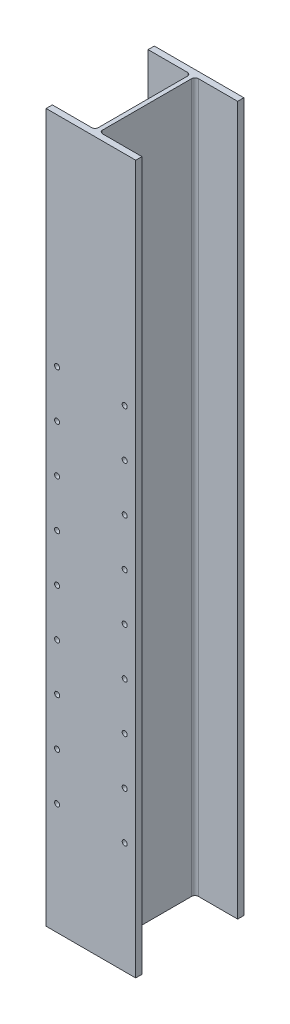
ISO-10303-21;
HEADER;
FILE_DESCRIPTION(('STEP AP214'),'2;1');
FILE_NAME('part.step','',(''),(''),'','','');
FILE_SCHEMA(('AUTOMOTIVE_DESIGN { 1 0 10303 214 1 1 1 1 }'));
ENDSEC;
DATA;
#1=APPLICATION_CONTEXT('core data for automotive mechanical design processes');
#2=APPLICATION_PROTOCOL_DEFINITION('international standard','automotive_design',2000,#1);
#3=PRODUCT_CONTEXT('',#1,'mechanical');
#4=PRODUCT('Part','Part','',(#3));
#5=PRODUCT_RELATED_PRODUCT_CATEGORY('part','',(#4));
#6=PRODUCT_DEFINITION_FORMATION('','',#4);
#7=PRODUCT_DEFINITION_CONTEXT('part definition',#1,'design');
#8=PRODUCT_DEFINITION('design','',#6,#7);
#9=PRODUCT_DEFINITION_SHAPE('','',#8);
#10=(LENGTH_UNIT() NAMED_UNIT(*) SI_UNIT(.MILLI.,.METRE.));
#11=(NAMED_UNIT(*) PLANE_ANGLE_UNIT() SI_UNIT($,.RADIAN.));
#12=(NAMED_UNIT(*) SI_UNIT($,.STERADIAN.) SOLID_ANGLE_UNIT());
#13=UNCERTAINTY_MEASURE_WITH_UNIT(LENGTH_MEASURE(1.E-05),#10,'distance_accuracy_value','');
#14=(GEOMETRIC_REPRESENTATION_CONTEXT(3) GLOBAL_UNCERTAINTY_ASSIGNED_CONTEXT((#13)) GLOBAL_UNIT_ASSIGNED_CONTEXT((#10,
#11,#12)) REPRESENTATION_CONTEXT('',''));
#15=CARTESIAN_POINT('',(0.,0.,0.));
#16=DIRECTION('',(0.,0.,1.));
#17=DIRECTION('',(1.,0.,0.));
#18=AXIS2_PLACEMENT_3D('',#15,#16,#17);
#19=CARTESIAN_POINT('',(-84.1375,665.1625,101.6));
#20=DIRECTION('',(0.,0.,-1.));
#21=DIRECTION('',(-1.,0.,0.));
#22=AXIS2_PLACEMENT_3D('',#19,#20,#21);
#23=PLANE('',#22);
#24=CARTESIAN_POINT('',(63.5,255.5875,101.6));
#25=DIRECTION('',(0.,0.,1.));
#26=DIRECTION('',(1.,0.,0.));
#27=AXIS2_PLACEMENT_3D('',#24,#25,#26);
#28=CIRCLE('',#27,4.76249999999999);
#29=CARTESIAN_POINT('',(68.2625,255.5875,101.6));
#30=VERTEX_POINT('',#29);
#31=EDGE_CURVE('E614',#30,#30,#28,.T.);
#32=ORIENTED_EDGE('',*,*,#31,.F.);
#33=EDGE_LOOP('',(#32));
#34=FACE_BOUND('',#33,.T.);
#35=CARTESIAN_POINT('',(63.4999999999999,-366.7125,101.6));
#36=DIRECTION('',(0.,0.,1.));
#37=DIRECTION('',(1.,0.,0.));
#38=AXIS2_PLACEMENT_3D('',#35,#36,#37);
#39=CIRCLE('',#38,4.76249999999999);
#40=CARTESIAN_POINT('',(68.2624999999999,-366.7125,101.6));
#41=VERTEX_POINT('',#40);
#42=EDGE_CURVE('E628',#41,#41,#39,.T.);
#43=ORIENTED_EDGE('',*,*,#42,.F.);
#44=EDGE_LOOP('',(#43));
#45=FACE_BOUND('',#44,.T.);
#46=CARTESIAN_POINT('',(63.4999999999999,-188.9125,101.6));
#47=DIRECTION('',(0.,0.,1.));
#48=DIRECTION('',(1.,0.,0.));
#49=AXIS2_PLACEMENT_3D('',#46,#47,#48);
#50=CIRCLE('',#49,4.76249999999999);
#51=CARTESIAN_POINT('',(68.2624999999999,-188.9125,101.6));
#52=VERTEX_POINT('',#51);
#53=EDGE_CURVE('E640',#52,#52,#50,.T.);
#54=ORIENTED_EDGE('',*,*,#53,.F.);
#55=EDGE_LOOP('',(#54));
#56=FACE_BOUND('',#55,.T.);
#57=CARTESIAN_POINT('',(63.4999999999999,-100.0125,101.6));
#58=DIRECTION('',(0.,0.,1.));
#59=DIRECTION('',(1.,0.,0.));
#60=AXIS2_PLACEMENT_3D('',#57,#58,#59);
#61=CIRCLE('',#60,4.76249999999999);
#62=CARTESIAN_POINT('',(68.2624999999999,-100.0125,101.6));
#63=VERTEX_POINT('',#62);
#64=EDGE_CURVE('E646',#63,#63,#61,.T.);
#65=ORIENTED_EDGE('',*,*,#64,.F.);
#66=EDGE_LOOP('',(#65));
#67=FACE_BOUND('',#66,.T.);
#68=CARTESIAN_POINT('',(-63.5,166.6875,101.6));
#69=DIRECTION('',(0.,0.,1.));
#70=DIRECTION('',(1.,0.,0.));
#71=AXIS2_PLACEMENT_3D('',#68,#69,#70);
#72=CIRCLE('',#71,4.76249999999999);
#73=CARTESIAN_POINT('',(-58.7375,166.6875,101.6));
#74=VERTEX_POINT('',#73);
#75=EDGE_CURVE('E706',#74,#74,#72,.T.);
#76=ORIENTED_EDGE('',*,*,#75,.F.);
#77=EDGE_LOOP('',(#76));
#78=FACE_BOUND('',#77,.T.);
#79=CARTESIAN_POINT('',(63.5,166.6875,101.6));
#80=DIRECTION('',(0.,0.,1.));
#81=DIRECTION('',(1.,0.,0.));
#82=AXIS2_PLACEMENT_3D('',#79,#80,#81);
#83=CIRCLE('',#82,4.76249999999999);
#84=CARTESIAN_POINT('',(68.2625,166.6875,101.6));
#85=VERTEX_POINT('',#84);
#86=EDGE_CURVE('E712',#85,#85,#83,.T.);
#87=ORIENTED_EDGE('',*,*,#86,.F.);
#88=EDGE_LOOP('',(#87));
#89=FACE_BOUND('',#88,.T.);
#90=DIRECTION('',(1.,0.,0.));
#91=VECTOR('',#90,1.);
#92=CARTESIAN_POINT('',(-84.1375,-665.1625,101.6));
#93=LINE('',#92,#91);
#94=CARTESIAN_POINT('',(-84.1375,-665.1625,101.6));
#95=VERTEX_POINT('',#94);
#96=CARTESIAN_POINT('',(84.1375,-665.1625,101.6));
#97=VERTEX_POINT('',#96);
#98=EDGE_CURVE('E194',#95,#97,#93,.T.);
#99=ORIENTED_EDGE('',*,*,#98,.T.);
#100=DIRECTION('',(0.,-1.,0.));
#101=VECTOR('',#100,1.);
#102=CARTESIAN_POINT('',(84.1375,665.1625,101.6));
#103=LINE('',#102,#101);
#104=CARTESIAN_POINT('',(84.1375,665.1625,101.6));
#105=VERTEX_POINT('',#104);
#106=EDGE_CURVE('E225',#105,#97,#103,.T.);
#107=ORIENTED_EDGE('',*,*,#106,.F.);
#108=DIRECTION('',(1.,0.,0.));
#109=VECTOR('',#108,1.);
#110=CARTESIAN_POINT('',(-84.1375,665.1625,101.6));
#111=LINE('',#110,#109);
#112=CARTESIAN_POINT('',(-84.1375,665.1625,101.6));
#113=VERTEX_POINT('',#112);
#114=EDGE_CURVE('E274',#113,#105,#111,.T.);
#115=ORIENTED_EDGE('',*,*,#114,.F.);
#116=DIRECTION('',(0.,-1.,0.));
#117=VECTOR('',#116,1.);
#118=CARTESIAN_POINT('',(-84.1375,665.1625,101.6));
#119=LINE('',#118,#117);
#120=EDGE_CURVE('E228',#113,#95,#119,.T.);
#121=ORIENTED_EDGE('',*,*,#120,.T.);
#122=EDGE_LOOP('',(#99,#107,#115,#121));
#123=FACE_BOUND('',#122,.T.);
#124=CARTESIAN_POINT('',(-63.5,77.7874999999999,101.6));
#125=DIRECTION('',(0.,0.,1.));
#126=DIRECTION('',(1.,0.,0.));
#127=AXIS2_PLACEMENT_3D('',#124,#125,#126);
#128=CIRCLE('',#127,4.76249999999999);
#129=CARTESIAN_POINT('',(-58.7375,77.7874999999999,101.6));
#130=VERTEX_POINT('',#129);
#131=EDGE_CURVE('E700',#130,#130,#128,.T.);
#132=ORIENTED_EDGE('',*,*,#131,.F.);
#133=EDGE_LOOP('',(#132));
#134=FACE_BOUND('',#133,.T.);
#135=CARTESIAN_POINT('',(-63.5,-11.1125000000001,101.6));
#136=DIRECTION('',(0.,0.,1.));
#137=DIRECTION('',(1.,0.,0.));
#138=AXIS2_PLACEMENT_3D('',#135,#136,#137);
#139=CIRCLE('',#138,4.76249999999999);
#140=CARTESIAN_POINT('',(-58.7375,-11.1125000000001,101.6));
#141=VERTEX_POINT('',#140);
#142=EDGE_CURVE('E694',#141,#141,#139,.T.);
#143=ORIENTED_EDGE('',*,*,#142,.F.);
#144=EDGE_LOOP('',(#143));
#145=FACE_BOUND('',#144,.T.);
#146=CARTESIAN_POINT('',(-63.5,-100.0125,101.6));
#147=DIRECTION('',(0.,0.,1.));
#148=DIRECTION('',(1.,0.,0.));
#149=AXIS2_PLACEMENT_3D('',#146,#147,#148);
#150=CIRCLE('',#149,4.76249999999999);
#151=CARTESIAN_POINT('',(-58.7375,-100.0125,101.6));
#152=VERTEX_POINT('',#151);
#153=EDGE_CURVE('E688',#152,#152,#150,.T.);
#154=ORIENTED_EDGE('',*,*,#153,.F.);
#155=EDGE_LOOP('',(#154));
#156=FACE_BOUND('',#155,.T.);
#157=CARTESIAN_POINT('',(-63.5,-188.9125,101.6));
#158=DIRECTION('',(0.,0.,1.));
#159=DIRECTION('',(1.,0.,0.));
#160=AXIS2_PLACEMENT_3D('',#157,#158,#159);
#161=CIRCLE('',#160,4.76249999999999);
#162=CARTESIAN_POINT('',(-58.7375,-188.9125,101.6));
#163=VERTEX_POINT('',#162);
#164=EDGE_CURVE('E682',#163,#163,#161,.T.);
#165=ORIENTED_EDGE('',*,*,#164,.F.);
#166=EDGE_LOOP('',(#165));
#167=FACE_BOUND('',#166,.T.);
#168=CARTESIAN_POINT('',(-63.4999999999999,-277.8125,101.6));
#169=DIRECTION('',(0.,0.,1.));
#170=DIRECTION('',(1.,0.,0.));
#171=AXIS2_PLACEMENT_3D('',#168,#169,#170);
#172=CIRCLE('',#171,4.76249999999999);
#173=CARTESIAN_POINT('',(-58.7375,-277.8125,101.6));
#174=VERTEX_POINT('',#173);
#175=EDGE_CURVE('E676',#174,#174,#172,.T.);
#176=ORIENTED_EDGE('',*,*,#175,.F.);
#177=EDGE_LOOP('',(#176));
#178=FACE_BOUND('',#177,.T.);
#179=CARTESIAN_POINT('',(-63.4999999999999,-366.7125,101.6));
#180=DIRECTION('',(0.,0.,1.));
#181=DIRECTION('',(1.,0.,0.));
#182=AXIS2_PLACEMENT_3D('',#179,#180,#181);
#183=CIRCLE('',#182,4.76249999999999);
#184=CARTESIAN_POINT('',(-58.7375,-366.7125,101.6));
#185=VERTEX_POINT('',#184);
#186=EDGE_CURVE('E670',#185,#185,#183,.T.);
#187=ORIENTED_EDGE('',*,*,#186,.F.);
#188=EDGE_LOOP('',(#187));
#189=FACE_BOUND('',#188,.T.);
#190=CARTESIAN_POINT('',(-63.4999999999999,-455.6125,101.6));
#191=DIRECTION('',(0.,0.,1.));
#192=DIRECTION('',(1.,0.,0.));
#193=AXIS2_PLACEMENT_3D('',#190,#191,#192);
#194=CIRCLE('',#193,4.76249999999999);
#195=CARTESIAN_POINT('',(-58.7374999999999,-455.6125,101.6));
#196=VERTEX_POINT('',#195);
#197=EDGE_CURVE('E664',#196,#196,#194,.T.);
#198=ORIENTED_EDGE('',*,*,#197,.F.);
#199=EDGE_LOOP('',(#198));
#200=FACE_BOUND('',#199,.T.);
#201=CARTESIAN_POINT('',(63.5,77.7874999999999,101.6));
#202=DIRECTION('',(0.,0.,1.));
#203=DIRECTION('',(1.,0.,0.));
#204=AXIS2_PLACEMENT_3D('',#201,#202,#203);
#205=CIRCLE('',#204,4.76249999999999);
#206=CARTESIAN_POINT('',(68.2624999999999,77.7874999999999,101.6));
#207=VERTEX_POINT('',#206);
#208=EDGE_CURVE('E658',#207,#207,#205,.T.);
#209=ORIENTED_EDGE('',*,*,#208,.F.);
#210=EDGE_LOOP('',(#209));
#211=FACE_BOUND('',#210,.T.);
#212=CARTESIAN_POINT('',(63.5,-11.1125000000001,101.6));
#213=DIRECTION('',(0.,0.,1.));
#214=DIRECTION('',(1.,0.,0.));
#215=AXIS2_PLACEMENT_3D('',#212,#213,#214);
#216=CIRCLE('',#215,4.76249999999999);
#217=CARTESIAN_POINT('',(68.2624999999999,-11.1125000000001,101.6));
#218=VERTEX_POINT('',#217);
#219=EDGE_CURVE('E652',#218,#218,#216,.T.);
#220=ORIENTED_EDGE('',*,*,#219,.F.);
#221=EDGE_LOOP('',(#220));
#222=FACE_BOUND('',#221,.T.);
#223=CARTESIAN_POINT('',(63.4999999999999,-277.8125,101.6));
#224=DIRECTION('',(0.,0.,1.));
#225=DIRECTION('',(1.,0.,0.));
#226=AXIS2_PLACEMENT_3D('',#223,#224,#225);
#227=CIRCLE('',#226,4.76249999999999);
#228=CARTESIAN_POINT('',(68.2624999999999,-277.8125,101.6));
#229=VERTEX_POINT('',#228);
#230=EDGE_CURVE('E634',#229,#229,#227,.T.);
#231=ORIENTED_EDGE('',*,*,#230,.F.);
#232=EDGE_LOOP('',(#231));
#233=FACE_BOUND('',#232,.T.);
#234=CARTESIAN_POINT('',(63.4999999999999,-455.6125,101.6));
#235=DIRECTION('',(0.,0.,1.));
#236=DIRECTION('',(1.,0.,0.));
#237=AXIS2_PLACEMENT_3D('',#234,#235,#236);
#238=CIRCLE('',#237,4.76249999999999);
#239=CARTESIAN_POINT('',(68.2624999999999,-455.6125,101.6));
#240=VERTEX_POINT('',#239);
#241=EDGE_CURVE('E622',#240,#240,#238,.T.);
#242=ORIENTED_EDGE('',*,*,#241,.F.);
#243=EDGE_LOOP('',(#242));
#244=FACE_BOUND('',#243,.T.);
#245=CARTESIAN_POINT('',(-63.5,255.5875,101.6));
#246=DIRECTION('',(0.,0.,1.));
#247=DIRECTION('',(1.,0.,0.));
#248=AXIS2_PLACEMENT_3D('',#245,#246,#247);
#249=CIRCLE('',#248,4.76249999999999);
#250=CARTESIAN_POINT('',(-58.7375,255.5875,101.6));
#251=VERTEX_POINT('',#250);
#252=EDGE_CURVE('E611',#251,#251,#249,.T.);
#253=ORIENTED_EDGE('',*,*,#252,.F.);
#254=EDGE_LOOP('',(#253));
#255=FACE_BOUND('',#254,.T.);
#256=ADVANCED_FACE('F33',(#34,#45,#56,#67,#78,#89,#123,#134,#145,#156,#167,#178,#189,#200,#211,
#222,#233,#244,#255),#23,.F.);
#257=CARTESIAN_POINT('',(-84.1375000000001,665.1625,-89.916));
#258=DIRECTION('',(1.,0.,0.));
#259=DIRECTION('',(0.,0.,-1.));
#260=AXIS2_PLACEMENT_3D('',#257,#258,#259);
#261=PLANE('',#260);
#262=DIRECTION('',(0.,0.,1.));
#263=VECTOR('',#262,1.);
#264=CARTESIAN_POINT('',(-84.1375000000001,-665.1625,-89.916));
#265=LINE('',#264,#263);
#266=CARTESIAN_POINT('',(-84.1375000000001,-665.1625,-101.6));
#267=VERTEX_POINT('',#266);
#268=CARTESIAN_POINT('',(-84.1375000000001,-665.1625,-89.916));
#269=VERTEX_POINT('',#268);
#270=EDGE_CURVE('E178',#267,#269,#265,.T.);
#271=ORIENTED_EDGE('',*,*,#270,.T.);
#272=DIRECTION('',(0.,-1.,0.));
#273=VECTOR('',#272,1.);
#274=CARTESIAN_POINT('',(-84.1375000000001,665.1625,-89.916));
#275=LINE('',#274,#273);
#276=CARTESIAN_POINT('',(-84.1375000000001,665.1625,-89.916));
#277=VERTEX_POINT('',#276);
#278=EDGE_CURVE('E11',#277,#269,#275,.T.);
#279=ORIENTED_EDGE('',*,*,#278,.F.);
#280=DIRECTION('',(0.,0.,1.));
#281=VECTOR('',#280,1.);
#282=CARTESIAN_POINT('',(-84.1375000000001,665.1625,-89.916));
#283=LINE('',#282,#281);
#284=CARTESIAN_POINT('',(-84.1375000000001,665.1625,-101.6));
#285=VERTEX_POINT('',#284);
#286=EDGE_CURVE('E209',#285,#277,#283,.T.);
#287=ORIENTED_EDGE('',*,*,#286,.F.);
#288=DIRECTION('',(0.,-1.,0.));
#289=VECTOR('',#288,1.);
#290=CARTESIAN_POINT('',(-84.1375000000001,665.1625,-101.6));
#291=LINE('',#290,#289);
#292=EDGE_CURVE('E174',#285,#267,#291,.T.);
#293=ORIENTED_EDGE('',*,*,#292,.T.);
#294=EDGE_LOOP('',(#271,#279,#287,#293));
#295=FACE_BOUND('',#294,.T.);
#296=ADVANCED_FACE('F35',(#295),#261,.F.);
#297=CARTESIAN_POINT('',(-10.31875,665.1625,-89.916));
#298=DIRECTION('',(0.,0.,-1.));
#299=DIRECTION('',(-1.,0.,0.));
#300=AXIS2_PLACEMENT_3D('',#297,#298,#299);
#301=PLANE('',#300);
#302=DIRECTION('',(1.,0.,0.));
#303=VECTOR('',#302,1.);
#304=CARTESIAN_POINT('',(-10.31875,-665.1625,-89.916));
#305=LINE('',#304,#303);
#306=CARTESIAN_POINT('',(-10.31875,-665.1625,-89.916));
#307=VERTEX_POINT('',#306);
#308=EDGE_CURVE('E181',#269,#307,#305,.T.);
#309=ORIENTED_EDGE('',*,*,#308,.T.);
#310=DIRECTION('',(0.,-1.,0.));
#311=VECTOR('',#310,1.);
#312=CARTESIAN_POINT('',(-10.31875,665.1625,-89.916));
#313=LINE('',#312,#311);
#314=CARTESIAN_POINT('',(-10.31875,665.1625,-89.916));
#315=VERTEX_POINT('',#314);
#316=EDGE_CURVE('E42',#315,#307,#313,.T.);
#317=ORIENTED_EDGE('',*,*,#316,.F.);
#318=DIRECTION('',(1.,0.,0.));
#319=VECTOR('',#318,1.);
#320=CARTESIAN_POINT('',(-10.31875,665.1625,-89.916));
#321=LINE('',#320,#319);
#322=EDGE_CURVE('E117',#277,#315,#321,.T.);
#323=ORIENTED_EDGE('',*,*,#322,.F.);
#324=ORIENTED_EDGE('',*,*,#278,.T.);
#325=EDGE_LOOP('',(#309,#317,#323,#324));
#326=FACE_BOUND('',#325,.T.);
#327=ADVANCED_FACE('F312',(#326),#301,.F.);
#328=CARTESIAN_POINT('',(-10.31875,665.1625,-83.566));
#329=DIRECTION('',(0.,-1.,0.));
#330=DIRECTION('',(0.,0.,-1.));
#331=AXIS2_PLACEMENT_3D('',#328,#329,#330);
#332=CYLINDRICAL_SURFACE('',#331,6.35);
#333=CARTESIAN_POINT('',(-10.31875,-665.1625,-83.566));
#334=DIRECTION('',(0.,-1.,0.));
#335=DIRECTION('',(0.,0.,1.));
#336=AXIS2_PLACEMENT_3D('',#333,#334,#335);
#337=CIRCLE('',#336,6.35);
#338=CARTESIAN_POINT('',(-3.96875,-665.1625,-83.566));
#339=VERTEX_POINT('',#338);
#340=EDGE_CURVE('E184',#307,#339,#337,.T.);
#341=ORIENTED_EDGE('',*,*,#340,.T.);
#342=DIRECTION('',(0.,-1.,0.));
#343=VECTOR('',#342,1.);
#344=CARTESIAN_POINT('',(-3.96875,665.1625,-83.566));
#345=LINE('',#344,#343);
#346=CARTESIAN_POINT('',(-3.96875,665.1625,-83.566));
#347=VERTEX_POINT('',#346);
#348=EDGE_CURVE('E240',#347,#339,#345,.T.);
#349=ORIENTED_EDGE('',*,*,#348,.F.);
#350=CARTESIAN_POINT('',(-10.31875,665.1625,-83.566));
#351=DIRECTION('',(0.,-1.,0.));
#352=DIRECTION('',(0.,0.,1.));
#353=AXIS2_PLACEMENT_3D('',#350,#351,#352);
#354=CIRCLE('',#353,6.35);
#355=EDGE_CURVE('E248',#315,#347,#354,.T.);
#356=ORIENTED_EDGE('',*,*,#355,.F.);
#357=ORIENTED_EDGE('',*,*,#316,.T.);
#358=EDGE_LOOP('',(#341,#349,#356,#357));
#359=FACE_BOUND('',#358,.T.);
#360=ADVANCED_FACE('F246',(#359),#332,.F.);
#361=CARTESIAN_POINT('',(-3.96875,665.1625,-83.566));
#362=DIRECTION('',(1.,0.,0.));
#363=DIRECTION('',(0.,0.,-1.));
#364=AXIS2_PLACEMENT_3D('',#361,#362,#363);
#365=PLANE('',#364);
#366=DIRECTION('',(0.,0.,1.));
#367=VECTOR('',#366,1.);
#368=CARTESIAN_POINT('',(-3.96875,-665.1625,-83.566));
#369=LINE('',#368,#367);
#370=CARTESIAN_POINT('',(-3.96874999999998,-665.1625,83.566));
#371=VERTEX_POINT('',#370);
#372=EDGE_CURVE('E186',#339,#371,#369,.T.);
#373=ORIENTED_EDGE('',*,*,#372,.T.);
#374=DIRECTION('',(0.,-1.,0.));
#375=VECTOR('',#374,1.);
#376=CARTESIAN_POINT('',(-3.96874999999998,665.1625,83.566));
#377=LINE('',#376,#375);
#378=CARTESIAN_POINT('',(-3.96874999999998,665.1625,83.566));
#379=VERTEX_POINT('',#378);
#380=EDGE_CURVE('E237',#379,#371,#377,.T.);
#381=ORIENTED_EDGE('',*,*,#380,.F.);
#382=DIRECTION('',(0.,0.,1.));
#383=VECTOR('',#382,1.);
#384=CARTESIAN_POINT('',(-3.96875,665.1625,-83.566));
#385=LINE('',#384,#383);
#386=EDGE_CURVE('E266',#347,#379,#385,.T.);
#387=ORIENTED_EDGE('',*,*,#386,.F.);
#388=ORIENTED_EDGE('',*,*,#348,.T.);
#389=EDGE_LOOP('',(#373,#381,#387,#388));
#390=FACE_BOUND('',#389,.T.);
#391=ADVANCED_FACE('F257',(#390),#365,.F.);
#392=CARTESIAN_POINT('',(-10.31875,665.1625,83.566));
#393=DIRECTION('',(0.,-1.,0.));
#394=DIRECTION('',(0.,0.,-1.));
#395=AXIS2_PLACEMENT_3D('',#392,#393,#394);
#396=CYLINDRICAL_SURFACE('',#395,6.35);
#397=CARTESIAN_POINT('',(-10.31875,-665.1625,83.566));
#398=DIRECTION('',(0.,-1.,0.));
#399=DIRECTION('',(0.,0.,1.));
#400=AXIS2_PLACEMENT_3D('',#397,#398,#399);
#401=CIRCLE('',#400,6.35);
#402=CARTESIAN_POINT('',(-10.31875,-665.1625,89.916));
#403=VERTEX_POINT('',#402);
#404=EDGE_CURVE('E188',#371,#403,#401,.T.);
#405=ORIENTED_EDGE('',*,*,#404,.T.);
#406=DIRECTION('',(0.,-1.,0.));
#407=VECTOR('',#406,1.);
#408=CARTESIAN_POINT('',(-10.31875,665.1625,89.916));
#409=LINE('',#408,#407);
#410=CARTESIAN_POINT('',(-10.31875,665.1625,89.916));
#411=VERTEX_POINT('',#410);
#412=EDGE_CURVE('E234',#411,#403,#409,.T.);
#413=ORIENTED_EDGE('',*,*,#412,.F.);
#414=CARTESIAN_POINT('',(-10.31875,665.1625,83.566));
#415=DIRECTION('',(0.,-1.,0.));
#416=DIRECTION('',(0.,0.,1.));
#417=AXIS2_PLACEMENT_3D('',#414,#415,#416);
#418=CIRCLE('',#417,6.35);
#419=EDGE_CURVE('E263',#379,#411,#418,.T.);
#420=ORIENTED_EDGE('',*,*,#419,.F.);
#421=ORIENTED_EDGE('',*,*,#380,.T.);
#422=EDGE_LOOP('',(#405,#413,#420,#421));
#423=FACE_BOUND('',#422,.T.);
#424=ADVANCED_FACE('F261',(#423),#396,.F.);
#425=CARTESIAN_POINT('',(-10.31875,665.1625,89.916));
#426=DIRECTION('',(0.,0.,1.));
#427=DIRECTION('',(1.,0.,0.));
#428=AXIS2_PLACEMENT_3D('',#425,#426,#427);
#429=PLANE('',#428);
#430=CARTESIAN_POINT('',(-63.5,255.5875,89.916));
#431=DIRECTION('',(0.,0.,1.));
#432=DIRECTION('',(1.,0.,0.));
#433=AXIS2_PLACEMENT_3D('',#430,#431,#432);
#434=CIRCLE('',#433,4.76249999999999);
#435=CARTESIAN_POINT('',(-58.7375,255.5875,89.916));
#436=VERTEX_POINT('',#435);
#437=EDGE_CURVE('E608',#436,#436,#434,.T.);
#438=ORIENTED_EDGE('',*,*,#437,.T.);
#439=EDGE_LOOP('',(#438));
#440=FACE_BOUND('',#439,.T.);
#441=CARTESIAN_POINT('',(-63.4999999999999,-455.6125,89.916));
#442=DIRECTION('',(0.,0.,1.));
#443=DIRECTION('',(1.,0.,0.));
#444=AXIS2_PLACEMENT_3D('',#441,#442,#443);
#445=CIRCLE('',#444,4.76249999999999);
#446=CARTESIAN_POINT('',(-58.7374999999999,-455.6125,89.916));
#447=VERTEX_POINT('',#446);
#448=EDGE_CURVE('E667',#447,#447,#445,.T.);
#449=ORIENTED_EDGE('',*,*,#448,.T.);
#450=EDGE_LOOP('',(#449));
#451=FACE_BOUND('',#450,.T.);
#452=CARTESIAN_POINT('',(-63.4999999999999,-366.7125,89.916));
#453=DIRECTION('',(0.,0.,1.));
#454=DIRECTION('',(1.,0.,0.));
#455=AXIS2_PLACEMENT_3D('',#452,#453,#454);
#456=CIRCLE('',#455,4.76249999999999);
#457=CARTESIAN_POINT('',(-58.7375,-366.7125,89.916));
#458=VERTEX_POINT('',#457);
#459=EDGE_CURVE('E673',#458,#458,#456,.T.);
#460=ORIENTED_EDGE('',*,*,#459,.T.);
#461=EDGE_LOOP('',(#460));
#462=FACE_BOUND('',#461,.T.);
#463=CARTESIAN_POINT('',(-63.4999999999999,-277.8125,89.916));
#464=DIRECTION('',(0.,0.,1.));
#465=DIRECTION('',(1.,0.,0.));
#466=AXIS2_PLACEMENT_3D('',#463,#464,#465);
#467=CIRCLE('',#466,4.76249999999999);
#468=CARTESIAN_POINT('',(-58.7375,-277.8125,89.916));
#469=VERTEX_POINT('',#468);
#470=EDGE_CURVE('E679',#469,#469,#467,.T.);
#471=ORIENTED_EDGE('',*,*,#470,.T.);
#472=EDGE_LOOP('',(#471));
#473=FACE_BOUND('',#472,.T.);
#474=CARTESIAN_POINT('',(-63.5,-188.9125,89.916));
#475=DIRECTION('',(0.,0.,1.));
#476=DIRECTION('',(1.,0.,0.));
#477=AXIS2_PLACEMENT_3D('',#474,#475,#476);
#478=CIRCLE('',#477,4.76249999999999);
#479=CARTESIAN_POINT('',(-58.7375,-188.9125,89.916));
#480=VERTEX_POINT('',#479);
#481=EDGE_CURVE('E685',#480,#480,#478,.T.);
#482=ORIENTED_EDGE('',*,*,#481,.T.);
#483=EDGE_LOOP('',(#482));
#484=FACE_BOUND('',#483,.T.);
#485=CARTESIAN_POINT('',(-63.5,-100.0125,89.916));
#486=DIRECTION('',(0.,0.,1.));
#487=DIRECTION('',(1.,0.,0.));
#488=AXIS2_PLACEMENT_3D('',#485,#486,#487);
#489=CIRCLE('',#488,4.76249999999999);
#490=CARTESIAN_POINT('',(-58.7375,-100.0125,89.916));
#491=VERTEX_POINT('',#490);
#492=EDGE_CURVE('E691',#491,#491,#489,.T.);
#493=ORIENTED_EDGE('',*,*,#492,.T.);
#494=EDGE_LOOP('',(#493));
#495=FACE_BOUND('',#494,.T.);
#496=CARTESIAN_POINT('',(-63.5,-11.1125000000001,89.916));
#497=DIRECTION('',(0.,0.,1.));
#498=DIRECTION('',(1.,0.,0.));
#499=AXIS2_PLACEMENT_3D('',#496,#497,#498);
#500=CIRCLE('',#499,4.76249999999999);
#501=CARTESIAN_POINT('',(-58.7375,-11.1125000000001,89.916));
#502=VERTEX_POINT('',#501);
#503=EDGE_CURVE('E697',#502,#502,#500,.T.);
#504=ORIENTED_EDGE('',*,*,#503,.T.);
#505=EDGE_LOOP('',(#504));
#506=FACE_BOUND('',#505,.T.);
#507=CARTESIAN_POINT('',(-63.5,77.7874999999999,89.916));
#508=DIRECTION('',(0.,0.,1.));
#509=DIRECTION('',(1.,0.,0.));
#510=AXIS2_PLACEMENT_3D('',#507,#508,#509);
#511=CIRCLE('',#510,4.76249999999999);
#512=CARTESIAN_POINT('',(-58.7375,77.7874999999999,89.916));
#513=VERTEX_POINT('',#512);
#514=EDGE_CURVE('E703',#513,#513,#511,.T.);
#515=ORIENTED_EDGE('',*,*,#514,.T.);
#516=EDGE_LOOP('',(#515));
#517=FACE_BOUND('',#516,.T.);
#518=CARTESIAN_POINT('',(-63.5,166.6875,89.916));
#519=DIRECTION('',(0.,0.,1.));
#520=DIRECTION('',(1.,0.,0.));
#521=AXIS2_PLACEMENT_3D('',#518,#519,#520);
#522=CIRCLE('',#521,4.76249999999999);
#523=CARTESIAN_POINT('',(-58.7375,166.6875,89.916));
#524=VERTEX_POINT('',#523);
#525=EDGE_CURVE('E709',#524,#524,#522,.T.);
#526=ORIENTED_EDGE('',*,*,#525,.T.);
#527=EDGE_LOOP('',(#526));
#528=FACE_BOUND('',#527,.T.);
#529=DIRECTION('',(-1.,0.,0.));
#530=VECTOR('',#529,1.);
#531=CARTESIAN_POINT('',(-10.31875,-665.1625,89.916));
#532=LINE('',#531,#530);
#533=CARTESIAN_POINT('',(-84.1375,-665.1625,89.916));
#534=VERTEX_POINT('',#533);
#535=EDGE_CURVE('E190',#403,#534,#532,.T.);
#536=ORIENTED_EDGE('',*,*,#535,.T.);
#537=DIRECTION('',(0.,-1.,0.));
#538=VECTOR('',#537,1.);
#539=CARTESIAN_POINT('',(-84.1375,665.1625,89.916));
#540=LINE('',#539,#538);
#541=CARTESIAN_POINT('',(-84.1375,665.1625,89.916));
#542=VERTEX_POINT('',#541);
#543=EDGE_CURVE('E231',#542,#534,#540,.T.);
#544=ORIENTED_EDGE('',*,*,#543,.F.);
#545=DIRECTION('',(-1.,0.,0.));
#546=VECTOR('',#545,1.);
#547=CARTESIAN_POINT('',(-10.31875,665.1625,89.916));
#548=LINE('',#547,#546);
#549=EDGE_CURVE('E265',#411,#542,#548,.T.);
#550=ORIENTED_EDGE('',*,*,#549,.F.);
#551=ORIENTED_EDGE('',*,*,#412,.T.);
#552=EDGE_LOOP('',(#536,#544,#550,#551));
#553=FACE_BOUND('',#552,.T.);
#554=ADVANCED_FACE('F322',(#440,#451,#462,#473,#484,#495,#506,#517,#528,#553),#429,.F.);
#555=CARTESIAN_POINT('',(-84.1375,665.1625,89.916));
#556=DIRECTION('',(1.,0.,0.));
#557=DIRECTION('',(0.,0.,-1.));
#558=AXIS2_PLACEMENT_3D('',#555,#556,#557);
#559=PLANE('',#558);
#560=DIRECTION('',(0.,0.,1.));
#561=VECTOR('',#560,1.);
#562=CARTESIAN_POINT('',(-84.1375,-665.1625,89.916));
#563=LINE('',#562,#561);
#564=EDGE_CURVE('E192',#534,#95,#563,.T.);
#565=ORIENTED_EDGE('',*,*,#564,.T.);
#566=ORIENTED_EDGE('',*,*,#120,.F.);
#567=DIRECTION('',(0.,0.,1.));
#568=VECTOR('',#567,1.);
#569=CARTESIAN_POINT('',(-84.1375,665.1625,89.916));
#570=LINE('',#569,#568);
#571=EDGE_CURVE('E268',#542,#113,#570,.T.);
#572=ORIENTED_EDGE('',*,*,#571,.F.);
#573=ORIENTED_EDGE('',*,*,#543,.T.);
#574=EDGE_LOOP('',(#565,#566,#572,#573));
#575=FACE_BOUND('',#574,.T.);
#576=ADVANCED_FACE('F319',(#575),#559,.F.);
#577=CARTESIAN_POINT('',(84.1375000000001,665.1625,89.916));
#578=DIRECTION('',(-1.,0.,0.));
#579=DIRECTION('',(0.,0.,1.));
#580=AXIS2_PLACEMENT_3D('',#577,#578,#579);
#581=PLANE('',#580);
#582=DIRECTION('',(0.,0.,-1.));
#583=VECTOR('',#582,1.);
#584=CARTESIAN_POINT('',(84.1375000000001,-665.1625,89.916));
#585=LINE('',#584,#583);
#586=CARTESIAN_POINT('',(84.1375000000001,-665.1625,89.916));
#587=VERTEX_POINT('',#586);
#588=EDGE_CURVE('E196',#97,#587,#585,.T.);
#589=ORIENTED_EDGE('',*,*,#588,.T.);
#590=DIRECTION('',(0.,-1.,0.));
#591=VECTOR('',#590,1.);
#592=CARTESIAN_POINT('',(84.1375000000001,665.1625,89.916));
#593=LINE('',#592,#591);
#594=CARTESIAN_POINT('',(84.1375000000001,665.1625,89.916));
#595=VERTEX_POINT('',#594);
#596=EDGE_CURVE('E222',#595,#587,#593,.T.);
#597=ORIENTED_EDGE('',*,*,#596,.F.);
#598=DIRECTION('',(0.,0.,-1.));
#599=VECTOR('',#598,1.);
#600=CARTESIAN_POINT('',(84.1375000000001,665.1625,89.916));
#601=LINE('',#600,#599);
#602=EDGE_CURVE('E276',#105,#595,#601,.T.);
#603=ORIENTED_EDGE('',*,*,#602,.F.);
#604=ORIENTED_EDGE('',*,*,#106,.T.);
#605=EDGE_LOOP('',(#589,#597,#603,#604));
#606=FACE_BOUND('',#605,.T.);
#607=ADVANCED_FACE('F317',(#606),#581,.F.);
#608=CARTESIAN_POINT('',(84.1375000000001,665.1625,89.916));
#609=DIRECTION('',(0.,0.,1.));
#610=DIRECTION('',(1.,0.,0.));
#611=AXIS2_PLACEMENT_3D('',#608,#609,#610);
#612=PLANE('',#611);
#613=CARTESIAN_POINT('',(63.5,255.5875,89.916));
#614=DIRECTION('',(0.,0.,1.));
#615=DIRECTION('',(1.,0.,0.));
#616=AXIS2_PLACEMENT_3D('',#613,#614,#615);
#617=CIRCLE('',#616,4.7625);
#618=CARTESIAN_POINT('',(68.2625,255.5875,89.916));
#619=VERTEX_POINT('',#618);
#620=EDGE_CURVE('E619',#619,#619,#617,.T.);
#621=ORIENTED_EDGE('',*,*,#620,.T.);
#622=EDGE_LOOP('',(#621));
#623=FACE_BOUND('',#622,.T.);
#624=CARTESIAN_POINT('',(63.4999999999999,-455.6125,89.916));
#625=DIRECTION('',(0.,0.,1.));
#626=DIRECTION('',(1.,0.,0.));
#627=AXIS2_PLACEMENT_3D('',#624,#625,#626);
#628=CIRCLE('',#627,4.7625);
#629=CARTESIAN_POINT('',(68.2624999999999,-455.6125,89.916));
#630=VERTEX_POINT('',#629);
#631=EDGE_CURVE('E625',#630,#630,#628,.T.);
#632=ORIENTED_EDGE('',*,*,#631,.T.);
#633=EDGE_LOOP('',(#632));
#634=FACE_BOUND('',#633,.T.);
#635=CARTESIAN_POINT('',(63.4999999999999,-366.7125,89.916));
#636=DIRECTION('',(0.,0.,1.));
#637=DIRECTION('',(1.,0.,0.));
#638=AXIS2_PLACEMENT_3D('',#635,#636,#637);
#639=CIRCLE('',#638,4.7625);
#640=CARTESIAN_POINT('',(68.2624999999999,-366.7125,89.916));
#641=VERTEX_POINT('',#640);
#642=EDGE_CURVE('E631',#641,#641,#639,.T.);
#643=ORIENTED_EDGE('',*,*,#642,.T.);
#644=EDGE_LOOP('',(#643));
#645=FACE_BOUND('',#644,.T.);
#646=CARTESIAN_POINT('',(63.4999999999999,-277.8125,89.916));
#647=DIRECTION('',(0.,0.,1.));
#648=DIRECTION('',(1.,0.,0.));
#649=AXIS2_PLACEMENT_3D('',#646,#647,#648);
#650=CIRCLE('',#649,4.7625);
#651=CARTESIAN_POINT('',(68.2624999999999,-277.8125,89.916));
#652=VERTEX_POINT('',#651);
#653=EDGE_CURVE('E637',#652,#652,#650,.T.);
#654=ORIENTED_EDGE('',*,*,#653,.T.);
#655=EDGE_LOOP('',(#654));
#656=FACE_BOUND('',#655,.T.);
#657=CARTESIAN_POINT('',(63.4999999999999,-188.9125,89.916));
#658=DIRECTION('',(0.,0.,1.));
#659=DIRECTION('',(1.,0.,0.));
#660=AXIS2_PLACEMENT_3D('',#657,#658,#659);
#661=CIRCLE('',#660,4.7625);
#662=CARTESIAN_POINT('',(68.2624999999999,-188.9125,89.916));
#663=VERTEX_POINT('',#662);
#664=EDGE_CURVE('E643',#663,#663,#661,.T.);
#665=ORIENTED_EDGE('',*,*,#664,.T.);
#666=EDGE_LOOP('',(#665));
#667=FACE_BOUND('',#666,.T.);
#668=CARTESIAN_POINT('',(63.4999999999999,-100.0125,89.916));
#669=DIRECTION('',(0.,0.,1.));
#670=DIRECTION('',(1.,0.,0.));
#671=AXIS2_PLACEMENT_3D('',#668,#669,#670);
#672=CIRCLE('',#671,4.7625);
#673=CARTESIAN_POINT('',(68.2624999999999,-100.0125,89.916));
#674=VERTEX_POINT('',#673);
#675=EDGE_CURVE('E649',#674,#674,#672,.T.);
#676=ORIENTED_EDGE('',*,*,#675,.T.);
#677=EDGE_LOOP('',(#676));
#678=FACE_BOUND('',#677,.T.);
#679=CARTESIAN_POINT('',(63.5,-11.1125000000001,89.916));
#680=DIRECTION('',(0.,0.,1.));
#681=DIRECTION('',(1.,0.,0.));
#682=AXIS2_PLACEMENT_3D('',#679,#680,#681);
#683=CIRCLE('',#682,4.7625);
#684=CARTESIAN_POINT('',(68.2624999999999,-11.1125000000001,89.916));
#685=VERTEX_POINT('',#684);
#686=EDGE_CURVE('E655',#685,#685,#683,.T.);
#687=ORIENTED_EDGE('',*,*,#686,.T.);
#688=EDGE_LOOP('',(#687));
#689=FACE_BOUND('',#688,.T.);
#690=CARTESIAN_POINT('',(63.5,77.7874999999999,89.916));
#691=DIRECTION('',(0.,0.,1.));
#692=DIRECTION('',(1.,0.,0.));
#693=AXIS2_PLACEMENT_3D('',#690,#691,#692);
#694=CIRCLE('',#693,4.7625);
#695=CARTESIAN_POINT('',(68.2624999999999,77.7874999999999,89.916));
#696=VERTEX_POINT('',#695);
#697=EDGE_CURVE('E661',#696,#696,#694,.T.);
#698=ORIENTED_EDGE('',*,*,#697,.T.);
#699=EDGE_LOOP('',(#698));
#700=FACE_BOUND('',#699,.T.);
#701=CARTESIAN_POINT('',(63.5,166.6875,89.916));
#702=DIRECTION('',(0.,0.,1.));
#703=DIRECTION('',(1.,0.,0.));
#704=AXIS2_PLACEMENT_3D('',#701,#702,#703);
#705=CIRCLE('',#704,4.7625);
#706=CARTESIAN_POINT('',(68.2625,166.6875,89.916));
#707=VERTEX_POINT('',#706);
#708=EDGE_CURVE('E182',#707,#707,#705,.T.);
#709=ORIENTED_EDGE('',*,*,#708,.T.);
#710=EDGE_LOOP('',(#709));
#711=FACE_BOUND('',#710,.T.);
#712=DIRECTION('',(-1.,0.,0.));
#713=VECTOR('',#712,1.);
#714=CARTESIAN_POINT('',(84.1375000000001,-665.1625,89.916));
#715=LINE('',#714,#713);
#716=CARTESIAN_POINT('',(10.3187500000001,-665.1625,89.916));
#717=VERTEX_POINT('',#716);
#718=EDGE_CURVE('E198',#587,#717,#715,.T.);
#719=ORIENTED_EDGE('',*,*,#718,.T.);
#720=DIRECTION('',(0.,-1.,0.));
#721=VECTOR('',#720,1.);
#722=CARTESIAN_POINT('',(10.3187500000001,665.1625,89.916));
#723=LINE('',#722,#721);
#724=CARTESIAN_POINT('',(10.3187500000001,665.1625,89.916));
#725=VERTEX_POINT('',#724);
#726=EDGE_CURVE('E219',#725,#717,#723,.T.);
#727=ORIENTED_EDGE('',*,*,#726,.F.);
#728=DIRECTION('',(-1.,0.,0.));
#729=VECTOR('',#728,1.);
#730=CARTESIAN_POINT('',(84.1375000000001,665.1625,89.916));
#731=LINE('',#730,#729);
#732=EDGE_CURVE('E278',#595,#725,#731,.T.);
#733=ORIENTED_EDGE('',*,*,#732,.F.);
#734=ORIENTED_EDGE('',*,*,#596,.T.);
#735=EDGE_LOOP('',(#719,#727,#733,#734));
#736=FACE_BOUND('',#735,.T.);
#737=ADVANCED_FACE('F364',(#623,#634,#645,#656,#667,#678,#689,#700,#711,#736),#612,.F.);
#738=CARTESIAN_POINT('',(10.31875,665.1625,83.566));
#739=DIRECTION('',(0.,-1.,0.));
#740=DIRECTION('',(0.,0.,-1.));
#741=AXIS2_PLACEMENT_3D('',#738,#739,#740);
#742=CYLINDRICAL_SURFACE('',#741,6.35);
#743=CARTESIAN_POINT('',(10.31875,-665.1625,83.566));
#744=DIRECTION('',(0.,-1.,0.));
#745=DIRECTION('',(0.,0.,-1.));
#746=AXIS2_PLACEMENT_3D('',#743,#744,#745);
#747=CIRCLE('',#746,6.35);
#748=CARTESIAN_POINT('',(3.96875000000002,-665.1625,83.566));
#749=VERTEX_POINT('',#748);
#750=EDGE_CURVE('E200',#717,#749,#747,.T.);
#751=ORIENTED_EDGE('',*,*,#750,.T.);
#752=DIRECTION('',(0.,-1.,0.));
#753=VECTOR('',#752,1.);
#754=CARTESIAN_POINT('',(3.96875000000002,665.1625,83.566));
#755=LINE('',#754,#753);
#756=CARTESIAN_POINT('',(3.96875000000002,665.1625,83.566));
#757=VERTEX_POINT('',#756);
#758=EDGE_CURVE('E216',#757,#749,#755,.T.);
#759=ORIENTED_EDGE('',*,*,#758,.F.);
#760=CARTESIAN_POINT('',(10.31875,665.1625,83.566));
#761=DIRECTION('',(0.,-1.,0.));
#762=DIRECTION('',(0.,0.,-1.));
#763=AXIS2_PLACEMENT_3D('',#760,#761,#762);
#764=CIRCLE('',#763,6.35);
#765=EDGE_CURVE('E280',#725,#757,#764,.T.);
#766=ORIENTED_EDGE('',*,*,#765,.F.);
#767=ORIENTED_EDGE('',*,*,#726,.T.);
#768=EDGE_LOOP('',(#751,#759,#766,#767));
#769=FACE_BOUND('',#768,.T.);
#770=ADVANCED_FACE('F371',(#769),#742,.F.);
#771=CARTESIAN_POINT('',(3.96875000000002,665.1625,83.566));
#772=DIRECTION('',(-1.,0.,0.));
#773=DIRECTION('',(0.,0.,1.));
#774=AXIS2_PLACEMENT_3D('',#771,#772,#773);
#775=PLANE('',#774);
#776=DIRECTION('',(0.,0.,-1.));
#777=VECTOR('',#776,1.);
#778=CARTESIAN_POINT('',(3.96875000000002,-665.1625,83.566));
#779=LINE('',#778,#777);
#780=CARTESIAN_POINT('',(3.96875,-665.1625,-83.566));
#781=VERTEX_POINT('',#780);
#782=EDGE_CURVE('E202',#749,#781,#779,.T.);
#783=ORIENTED_EDGE('',*,*,#782,.T.);
#784=DIRECTION('',(0.,-1.,0.));
#785=VECTOR('',#784,1.);
#786=CARTESIAN_POINT('',(3.96875,665.1625,-83.566));
#787=LINE('',#786,#785);
#788=CARTESIAN_POINT('',(3.96875,665.1625,-83.566));
#789=VERTEX_POINT('',#788);
#790=EDGE_CURVE('E213',#789,#781,#787,.T.);
#791=ORIENTED_EDGE('',*,*,#790,.F.);
#792=DIRECTION('',(0.,0.,-1.));
#793=VECTOR('',#792,1.);
#794=CARTESIAN_POINT('',(3.96875000000002,665.1625,83.566));
#795=LINE('',#794,#793);
#796=EDGE_CURVE('E282',#757,#789,#795,.T.);
#797=ORIENTED_EDGE('',*,*,#796,.F.);
#798=ORIENTED_EDGE('',*,*,#758,.T.);
#799=EDGE_LOOP('',(#783,#791,#797,#798));
#800=FACE_BOUND('',#799,.T.);
#801=ADVANCED_FACE('F288',(#800),#775,.F.);
#802=CARTESIAN_POINT('',(10.31875,665.1625,-83.566));
#803=DIRECTION('',(0.,-1.,0.));
#804=DIRECTION('',(0.,0.,-1.));
#805=AXIS2_PLACEMENT_3D('',#802,#803,#804);
#806=CYLINDRICAL_SURFACE('',#805,6.35);
#807=CARTESIAN_POINT('',(10.31875,-665.1625,-83.566));
#808=DIRECTION('',(0.,-1.,0.));
#809=DIRECTION('',(0.,0.,-1.));
#810=AXIS2_PLACEMENT_3D('',#807,#808,#809);
#811=CIRCLE('',#810,6.35);
#812=CARTESIAN_POINT('',(10.31875,-665.1625,-89.916));
#813=VERTEX_POINT('',#812);
#814=EDGE_CURVE('E204',#781,#813,#811,.T.);
#815=ORIENTED_EDGE('',*,*,#814,.T.);
#816=DIRECTION('',(0.,-1.,0.));
#817=VECTOR('',#816,1.);
#818=CARTESIAN_POINT('',(10.31875,665.1625,-89.916));
#819=LINE('',#818,#817);
#820=CARTESIAN_POINT('',(10.31875,665.1625,-89.916));
#821=VERTEX_POINT('',#820);
#822=EDGE_CURVE('E169',#821,#813,#819,.T.);
#823=ORIENTED_EDGE('',*,*,#822,.F.);
#824=CARTESIAN_POINT('',(10.31875,665.1625,-83.566));
#825=DIRECTION('',(0.,-1.,0.));
#826=DIRECTION('',(0.,0.,-1.));
#827=AXIS2_PLACEMENT_3D('',#824,#825,#826);
#828=CIRCLE('',#827,6.35);
#829=EDGE_CURVE('E160',#789,#821,#828,.T.);
#830=ORIENTED_EDGE('',*,*,#829,.F.);
#831=ORIENTED_EDGE('',*,*,#790,.T.);
#832=EDGE_LOOP('',(#815,#823,#830,#831));
#833=FACE_BOUND('',#832,.T.);
#834=ADVANCED_FACE('F292',(#833),#806,.F.);
#835=CARTESIAN_POINT('',(84.1375000000001,665.1625,-89.916));
#836=DIRECTION('',(0.,0.,-1.));
#837=DIRECTION('',(-1.,0.,0.));
#838=AXIS2_PLACEMENT_3D('',#835,#836,#837);
#839=PLANE('',#838);
#840=DIRECTION('',(1.,0.,0.));
#841=VECTOR('',#840,1.);
#842=CARTESIAN_POINT('',(84.1375000000001,-665.1625,-89.916));
#843=LINE('',#842,#841);
#844=CARTESIAN_POINT('',(84.1375000000001,-665.1625,-89.916));
#845=VERTEX_POINT('',#844);
#846=EDGE_CURVE('E168',#813,#845,#843,.T.);
#847=ORIENTED_EDGE('',*,*,#846,.T.);
#848=DIRECTION('',(0.,-1.,0.));
#849=VECTOR('',#848,1.);
#850=CARTESIAN_POINT('',(84.1375000000001,665.1625,-89.916));
#851=LINE('',#850,#849);
#852=CARTESIAN_POINT('',(84.1375000000001,665.1625,-89.916));
#853=VERTEX_POINT('',#852);
#854=EDGE_CURVE('E165',#853,#845,#851,.T.);
#855=ORIENTED_EDGE('',*,*,#854,.F.);
#856=DIRECTION('',(1.,0.,0.));
#857=VECTOR('',#856,1.);
#858=CARTESIAN_POINT('',(84.1375000000001,665.1625,-89.916));
#859=LINE('',#858,#857);
#860=EDGE_CURVE('E154',#821,#853,#859,.T.);
#861=ORIENTED_EDGE('',*,*,#860,.F.);
#862=ORIENTED_EDGE('',*,*,#822,.T.);
#863=EDGE_LOOP('',(#847,#855,#861,#862));
#864=FACE_BOUND('',#863,.T.);
#865=ADVANCED_FACE('F166',(#864),#839,.F.);
#866=CARTESIAN_POINT('',(84.1375,665.1625,-101.6));
#867=DIRECTION('',(-1.,0.,0.));
#868=DIRECTION('',(0.,0.,1.));
#869=AXIS2_PLACEMENT_3D('',#866,#867,#868);
#870=PLANE('',#869);
#871=DIRECTION('',(0.,0.,-1.));
#872=VECTOR('',#871,1.);
#873=CARTESIAN_POINT('',(84.1375,-665.1625,-101.6));
#874=LINE('',#873,#872);
#875=CARTESIAN_POINT('',(84.1375,-665.1625,-101.6));
#876=VERTEX_POINT('',#875);
#877=EDGE_CURVE('E103',#845,#876,#874,.T.);
#878=ORIENTED_EDGE('',*,*,#877,.T.);
#879=DIRECTION('',(0.,-1.,0.));
#880=VECTOR('',#879,1.);
#881=CARTESIAN_POINT('',(84.1375,665.1625,-101.6));
#882=LINE('',#881,#880);
#883=CARTESIAN_POINT('',(84.1375,665.1625,-101.6));
#884=VERTEX_POINT('',#883);
#885=EDGE_CURVE('E170',#884,#876,#882,.T.);
#886=ORIENTED_EDGE('',*,*,#885,.F.);
#887=DIRECTION('',(0.,0.,-1.));
#888=VECTOR('',#887,1.);
#889=CARTESIAN_POINT('',(84.1375,665.1625,-101.6));
#890=LINE('',#889,#888);
#891=EDGE_CURVE('E158',#853,#884,#890,.T.);
#892=ORIENTED_EDGE('',*,*,#891,.F.);
#893=ORIENTED_EDGE('',*,*,#854,.T.);
#894=EDGE_LOOP('',(#878,#886,#892,#893));
#895=FACE_BOUND('',#894,.T.);
#896=ADVANCED_FACE('F172',(#895),#870,.F.);
#897=CARTESIAN_POINT('',(-84.1375000000001,665.1625,-101.6));
#898=DIRECTION('',(0.,0.,1.));
#899=DIRECTION('',(1.,0.,0.));
#900=AXIS2_PLACEMENT_3D('',#897,#898,#899);
#901=PLANE('',#900);
#902=DIRECTION('',(-1.,0.,0.));
#903=VECTOR('',#902,1.);
#904=CARTESIAN_POINT('',(-84.1375000000001,-665.1625,-101.6));
#905=LINE('',#904,#903);
#906=EDGE_CURVE('E109',#876,#267,#905,.T.);
#907=ORIENTED_EDGE('',*,*,#906,.T.);
#908=ORIENTED_EDGE('',*,*,#292,.F.);
#909=DIRECTION('',(-1.,0.,0.));
#910=VECTOR('',#909,1.);
#911=CARTESIAN_POINT('',(-84.1375000000001,665.1625,-101.6));
#912=LINE('',#911,#910);
#913=EDGE_CURVE('E50',#884,#285,#912,.T.);
#914=ORIENTED_EDGE('',*,*,#913,.F.);
#915=ORIENTED_EDGE('',*,*,#885,.T.);
#916=EDGE_LOOP('',(#907,#908,#914,#915));
#917=FACE_BOUND('',#916,.T.);
#918=ADVANCED_FACE('F296',(#917),#901,.F.);
#919=CARTESIAN_POINT('',(10.31875,665.1625,-83.566));
#920=DIRECTION('',(0.,-1.,0.));
#921=DIRECTION('',(0.,0.,-1.));
#922=AXIS2_PLACEMENT_3D('',#919,#920,#921);
#923=PLANE('',#922);
#924=ORIENTED_EDGE('',*,*,#286,.T.);
#925=ORIENTED_EDGE('',*,*,#322,.T.);
#926=ORIENTED_EDGE('',*,*,#355,.T.);
#927=ORIENTED_EDGE('',*,*,#386,.T.);
#928=ORIENTED_EDGE('',*,*,#419,.T.);
#929=ORIENTED_EDGE('',*,*,#549,.T.);
#930=ORIENTED_EDGE('',*,*,#571,.T.);
#931=ORIENTED_EDGE('',*,*,#114,.T.);
#932=ORIENTED_EDGE('',*,*,#602,.T.);
#933=ORIENTED_EDGE('',*,*,#732,.T.);
#934=ORIENTED_EDGE('',*,*,#765,.T.);
#935=ORIENTED_EDGE('',*,*,#796,.T.);
#936=ORIENTED_EDGE('',*,*,#829,.T.);
#937=ORIENTED_EDGE('',*,*,#860,.T.);
#938=ORIENTED_EDGE('',*,*,#891,.T.);
#939=ORIENTED_EDGE('',*,*,#913,.T.);
#940=EDGE_LOOP('',(#924,#925,#926,#927,#928,#929,#930,#931,#932,#933,#934,#935,#936,#937,#938,#939));
#941=FACE_BOUND('',#940,.T.);
#942=ADVANCED_FACE('F156',(#941),#923,.F.);
#943=CARTESIAN_POINT('',(10.31875,-665.1625,-83.566));
#944=DIRECTION('',(0.,-1.,0.));
#945=DIRECTION('',(0.,0.,-1.));
#946=AXIS2_PLACEMENT_3D('',#943,#944,#945);
#947=PLANE('',#946);
#948=ORIENTED_EDGE('',*,*,#270,.F.);
#949=ORIENTED_EDGE('',*,*,#906,.F.);
#950=ORIENTED_EDGE('',*,*,#877,.F.);
#951=ORIENTED_EDGE('',*,*,#846,.F.);
#952=ORIENTED_EDGE('',*,*,#814,.F.);
#953=ORIENTED_EDGE('',*,*,#782,.F.);
#954=ORIENTED_EDGE('',*,*,#750,.F.);
#955=ORIENTED_EDGE('',*,*,#718,.F.);
#956=ORIENTED_EDGE('',*,*,#588,.F.);
#957=ORIENTED_EDGE('',*,*,#98,.F.);
#958=ORIENTED_EDGE('',*,*,#564,.F.);
#959=ORIENTED_EDGE('',*,*,#535,.F.);
#960=ORIENTED_EDGE('',*,*,#404,.F.);
#961=ORIENTED_EDGE('',*,*,#372,.F.);
#962=ORIENTED_EDGE('',*,*,#340,.F.);
#963=ORIENTED_EDGE('',*,*,#308,.F.);
#964=EDGE_LOOP('',(#948,#949,#950,#951,#952,#953,#954,#955,#956,#957,#958,#959,#960,#961,#962,#963));
#965=FACE_BOUND('',#964,.T.);
#966=ADVANCED_FACE('F252',(#965),#947,.T.);
#967=CARTESIAN_POINT('',(63.5,166.6875,101.6));
#968=DIRECTION('',(0.,0.,1.));
#969=DIRECTION('',(1.,0.,0.));
#970=AXIS2_PLACEMENT_3D('',#967,#968,#969);
#971=CYLINDRICAL_SURFACE('',#970,4.7625);
#972=ORIENTED_EDGE('',*,*,#708,.F.);
#973=EDGE_LOOP('',(#972));
#974=FACE_BOUND('',#973,.T.);
#975=ORIENTED_EDGE('',*,*,#86,.T.);
#976=EDGE_LOOP('',(#975));
#977=FACE_BOUND('',#976,.T.);
#978=ADVANCED_FACE('F419',(#974,#977),#971,.F.);
#979=CARTESIAN_POINT('',(-63.5,166.6875,101.6));
#980=DIRECTION('',(0.,0.,1.));
#981=DIRECTION('',(1.,0.,0.));
#982=AXIS2_PLACEMENT_3D('',#979,#980,#981);
#983=CYLINDRICAL_SURFACE('',#982,4.76249999999999);
#984=ORIENTED_EDGE('',*,*,#525,.F.);
#985=EDGE_LOOP('',(#984));
#986=FACE_BOUND('',#985,.T.);
#987=ORIENTED_EDGE('',*,*,#75,.T.);
#988=EDGE_LOOP('',(#987));
#989=FACE_BOUND('',#988,.T.);
#990=ADVANCED_FACE('F432',(#986,#989),#983,.F.);
#991=CARTESIAN_POINT('',(-63.5,77.7874999999999,101.6));
#992=DIRECTION('',(0.,0.,1.));
#993=DIRECTION('',(1.,0.,0.));
#994=AXIS2_PLACEMENT_3D('',#991,#992,#993);
#995=CYLINDRICAL_SURFACE('',#994,4.76249999999999);
#996=ORIENTED_EDGE('',*,*,#514,.F.);
#997=EDGE_LOOP('',(#996));
#998=FACE_BOUND('',#997,.T.);
#999=ORIENTED_EDGE('',*,*,#131,.T.);
#1000=EDGE_LOOP('',(#999));
#1001=FACE_BOUND('',#1000,.T.);
#1002=ADVANCED_FACE('F441',(#998,#1001),#995,.F.);
#1003=CARTESIAN_POINT('',(-63.5,-11.1125000000001,101.6));
#1004=DIRECTION('',(0.,0.,1.));
#1005=DIRECTION('',(1.,0.,0.));
#1006=AXIS2_PLACEMENT_3D('',#1003,#1004,#1005);
#1007=CYLINDRICAL_SURFACE('',#1006,4.76249999999999);
#1008=ORIENTED_EDGE('',*,*,#503,.F.);
#1009=EDGE_LOOP('',(#1008));
#1010=FACE_BOUND('',#1009,.T.);
#1011=ORIENTED_EDGE('',*,*,#142,.T.);
#1012=EDGE_LOOP('',(#1011));
#1013=FACE_BOUND('',#1012,.T.);
#1014=ADVANCED_FACE('F450',(#1010,#1013),#1007,.F.);
#1015=CARTESIAN_POINT('',(-63.5,-100.0125,101.6));
#1016=DIRECTION('',(0.,0.,1.));
#1017=DIRECTION('',(1.,0.,0.));
#1018=AXIS2_PLACEMENT_3D('',#1015,#1016,#1017);
#1019=CYLINDRICAL_SURFACE('',#1018,4.76249999999999);
#1020=ORIENTED_EDGE('',*,*,#492,.F.);
#1021=EDGE_LOOP('',(#1020));
#1022=FACE_BOUND('',#1021,.T.);
#1023=ORIENTED_EDGE('',*,*,#153,.T.);
#1024=EDGE_LOOP('',(#1023));
#1025=FACE_BOUND('',#1024,.T.);
#1026=ADVANCED_FACE('F459',(#1022,#1025),#1019,.F.);
#1027=CARTESIAN_POINT('',(-63.5,-188.9125,101.6));
#1028=DIRECTION('',(0.,0.,1.));
#1029=DIRECTION('',(1.,0.,0.));
#1030=AXIS2_PLACEMENT_3D('',#1027,#1028,#1029);
#1031=CYLINDRICAL_SURFACE('',#1030,4.76249999999999);
#1032=ORIENTED_EDGE('',*,*,#481,.F.);
#1033=EDGE_LOOP('',(#1032));
#1034=FACE_BOUND('',#1033,.T.);
#1035=ORIENTED_EDGE('',*,*,#164,.T.);
#1036=EDGE_LOOP('',(#1035));
#1037=FACE_BOUND('',#1036,.T.);
#1038=ADVANCED_FACE('F468',(#1034,#1037),#1031,.F.);
#1039=CARTESIAN_POINT('',(-63.4999999999999,-277.8125,101.6));
#1040=DIRECTION('',(0.,0.,1.));
#1041=DIRECTION('',(1.,0.,0.));
#1042=AXIS2_PLACEMENT_3D('',#1039,#1040,#1041);
#1043=CYLINDRICAL_SURFACE('',#1042,4.76249999999999);
#1044=ORIENTED_EDGE('',*,*,#470,.F.);
#1045=EDGE_LOOP('',(#1044));
#1046=FACE_BOUND('',#1045,.T.);
#1047=ORIENTED_EDGE('',*,*,#175,.T.);
#1048=EDGE_LOOP('',(#1047));
#1049=FACE_BOUND('',#1048,.T.);
#1050=ADVANCED_FACE('F477',(#1046,#1049),#1043,.F.);
#1051=CARTESIAN_POINT('',(-63.4999999999999,-366.7125,101.6));
#1052=DIRECTION('',(0.,0.,1.));
#1053=DIRECTION('',(1.,0.,0.));
#1054=AXIS2_PLACEMENT_3D('',#1051,#1052,#1053);
#1055=CYLINDRICAL_SURFACE('',#1054,4.76249999999999);
#1056=ORIENTED_EDGE('',*,*,#459,.F.);
#1057=EDGE_LOOP('',(#1056));
#1058=FACE_BOUND('',#1057,.T.);
#1059=ORIENTED_EDGE('',*,*,#186,.T.);
#1060=EDGE_LOOP('',(#1059));
#1061=FACE_BOUND('',#1060,.T.);
#1062=ADVANCED_FACE('F486',(#1058,#1061),#1055,.F.);
#1063=CARTESIAN_POINT('',(-63.4999999999999,-455.6125,101.6));
#1064=DIRECTION('',(0.,0.,1.));
#1065=DIRECTION('',(1.,0.,0.));
#1066=AXIS2_PLACEMENT_3D('',#1063,#1064,#1065);
#1067=CYLINDRICAL_SURFACE('',#1066,4.76249999999999);
#1068=ORIENTED_EDGE('',*,*,#448,.F.);
#1069=EDGE_LOOP('',(#1068));
#1070=FACE_BOUND('',#1069,.T.);
#1071=ORIENTED_EDGE('',*,*,#197,.T.);
#1072=EDGE_LOOP('',(#1071));
#1073=FACE_BOUND('',#1072,.T.);
#1074=ADVANCED_FACE('F495',(#1070,#1073),#1067,.F.);
#1075=CARTESIAN_POINT('',(63.5,77.7874999999999,101.6));
#1076=DIRECTION('',(0.,0.,1.));
#1077=DIRECTION('',(1.,0.,0.));
#1078=AXIS2_PLACEMENT_3D('',#1075,#1076,#1077);
#1079=CYLINDRICAL_SURFACE('',#1078,4.7625);
#1080=ORIENTED_EDGE('',*,*,#697,.F.);
#1081=EDGE_LOOP('',(#1080));
#1082=FACE_BOUND('',#1081,.T.);
#1083=ORIENTED_EDGE('',*,*,#208,.T.);
#1084=EDGE_LOOP('',(#1083));
#1085=FACE_BOUND('',#1084,.T.);
#1086=ADVANCED_FACE('F504',(#1082,#1085),#1079,.F.);
#1087=CARTESIAN_POINT('',(63.5,-11.1125000000001,101.6));
#1088=DIRECTION('',(0.,0.,1.));
#1089=DIRECTION('',(1.,0.,0.));
#1090=AXIS2_PLACEMENT_3D('',#1087,#1088,#1089);
#1091=CYLINDRICAL_SURFACE('',#1090,4.7625);
#1092=ORIENTED_EDGE('',*,*,#686,.F.);
#1093=EDGE_LOOP('',(#1092));
#1094=FACE_BOUND('',#1093,.T.);
#1095=ORIENTED_EDGE('',*,*,#219,.T.);
#1096=EDGE_LOOP('',(#1095));
#1097=FACE_BOUND('',#1096,.T.);
#1098=ADVANCED_FACE('F513',(#1094,#1097),#1091,.F.);
#1099=CARTESIAN_POINT('',(63.4999999999999,-100.0125,101.6));
#1100=DIRECTION('',(0.,0.,1.));
#1101=DIRECTION('',(1.,0.,0.));
#1102=AXIS2_PLACEMENT_3D('',#1099,#1100,#1101);
#1103=CYLINDRICAL_SURFACE('',#1102,4.7625);
#1104=ORIENTED_EDGE('',*,*,#675,.F.);
#1105=EDGE_LOOP('',(#1104));
#1106=FACE_BOUND('',#1105,.T.);
#1107=ORIENTED_EDGE('',*,*,#64,.T.);
#1108=EDGE_LOOP('',(#1107));
#1109=FACE_BOUND('',#1108,.T.);
#1110=ADVANCED_FACE('F522',(#1106,#1109),#1103,.F.);
#1111=CARTESIAN_POINT('',(63.4999999999999,-188.9125,101.6));
#1112=DIRECTION('',(0.,0.,1.));
#1113=DIRECTION('',(1.,0.,0.));
#1114=AXIS2_PLACEMENT_3D('',#1111,#1112,#1113);
#1115=CYLINDRICAL_SURFACE('',#1114,4.7625);
#1116=ORIENTED_EDGE('',*,*,#664,.F.);
#1117=EDGE_LOOP('',(#1116));
#1118=FACE_BOUND('',#1117,.T.);
#1119=ORIENTED_EDGE('',*,*,#53,.T.);
#1120=EDGE_LOOP('',(#1119));
#1121=FACE_BOUND('',#1120,.T.);
#1122=ADVANCED_FACE('F531',(#1118,#1121),#1115,.F.);
#1123=CARTESIAN_POINT('',(63.4999999999999,-277.8125,101.6));
#1124=DIRECTION('',(0.,0.,1.));
#1125=DIRECTION('',(1.,0.,0.));
#1126=AXIS2_PLACEMENT_3D('',#1123,#1124,#1125);
#1127=CYLINDRICAL_SURFACE('',#1126,4.7625);
#1128=ORIENTED_EDGE('',*,*,#653,.F.);
#1129=EDGE_LOOP('',(#1128));
#1130=FACE_BOUND('',#1129,.T.);
#1131=ORIENTED_EDGE('',*,*,#230,.T.);
#1132=EDGE_LOOP('',(#1131));
#1133=FACE_BOUND('',#1132,.T.);
#1134=ADVANCED_FACE('F540',(#1130,#1133),#1127,.F.);
#1135=CARTESIAN_POINT('',(63.4999999999999,-366.7125,101.6));
#1136=DIRECTION('',(0.,0.,1.));
#1137=DIRECTION('',(1.,0.,0.));
#1138=AXIS2_PLACEMENT_3D('',#1135,#1136,#1137);
#1139=CYLINDRICAL_SURFACE('',#1138,4.7625);
#1140=ORIENTED_EDGE('',*,*,#642,.F.);
#1141=EDGE_LOOP('',(#1140));
#1142=FACE_BOUND('',#1141,.T.);
#1143=ORIENTED_EDGE('',*,*,#42,.T.);
#1144=EDGE_LOOP('',(#1143));
#1145=FACE_BOUND('',#1144,.T.);
#1146=ADVANCED_FACE('F549',(#1142,#1145),#1139,.F.);
#1147=CARTESIAN_POINT('',(63.4999999999999,-455.6125,101.6));
#1148=DIRECTION('',(0.,0.,1.));
#1149=DIRECTION('',(1.,0.,0.));
#1150=AXIS2_PLACEMENT_3D('',#1147,#1148,#1149);
#1151=CYLINDRICAL_SURFACE('',#1150,4.7625);
#1152=ORIENTED_EDGE('',*,*,#631,.F.);
#1153=EDGE_LOOP('',(#1152));
#1154=FACE_BOUND('',#1153,.T.);
#1155=ORIENTED_EDGE('',*,*,#241,.T.);
#1156=EDGE_LOOP('',(#1155));
#1157=FACE_BOUND('',#1156,.T.);
#1158=ADVANCED_FACE('F558',(#1154,#1157),#1151,.F.);
#1159=CARTESIAN_POINT('',(63.5,255.5875,101.6));
#1160=DIRECTION('',(0.,0.,1.));
#1161=DIRECTION('',(1.,0.,0.));
#1162=AXIS2_PLACEMENT_3D('',#1159,#1160,#1161);
#1163=CYLINDRICAL_SURFACE('',#1162,4.7625);
#1164=ORIENTED_EDGE('',*,*,#620,.F.);
#1165=EDGE_LOOP('',(#1164));
#1166=FACE_BOUND('',#1165,.T.);
#1167=ORIENTED_EDGE('',*,*,#31,.T.);
#1168=EDGE_LOOP('',(#1167));
#1169=FACE_BOUND('',#1168,.T.);
#1170=ADVANCED_FACE('F567',(#1166,#1169),#1163,.F.);
#1171=CARTESIAN_POINT('',(-63.5,255.5875,101.6));
#1172=DIRECTION('',(0.,0.,1.));
#1173=DIRECTION('',(1.,0.,0.));
#1174=AXIS2_PLACEMENT_3D('',#1171,#1172,#1173);
#1175=CYLINDRICAL_SURFACE('',#1174,4.76249999999999);
#1176=ORIENTED_EDGE('',*,*,#437,.F.);
#1177=EDGE_LOOP('',(#1176));
#1178=FACE_BOUND('',#1177,.T.);
#1179=ORIENTED_EDGE('',*,*,#252,.T.);
#1180=EDGE_LOOP('',(#1179));
#1181=FACE_BOUND('',#1180,.T.);
#1182=ADVANCED_FACE('F576',(#1178,#1181),#1175,.F.);
#1183=CLOSED_SHELL('',(#256,#296,#327,#360,#391,#424,#554,#576,#607,#737,#770,#801,#834,#865,
#896,#918,#942,#966,#978,#990,#1002,#1014,#1026,#1038,#1050,#1062,#1074,#1086,#1098,#1110,#1122,
#1134,#1146,#1158,#1170,#1182));
#1184=MANIFOLD_SOLID_BREP('B2',#1183);
#1185=ADVANCED_BREP_SHAPE_REPRESENTATION('',(#18,#1184),#14);
#1186=SHAPE_DEFINITION_REPRESENTATION(#9,#1185);
ENDSEC;
END-ISO-10303-21;
